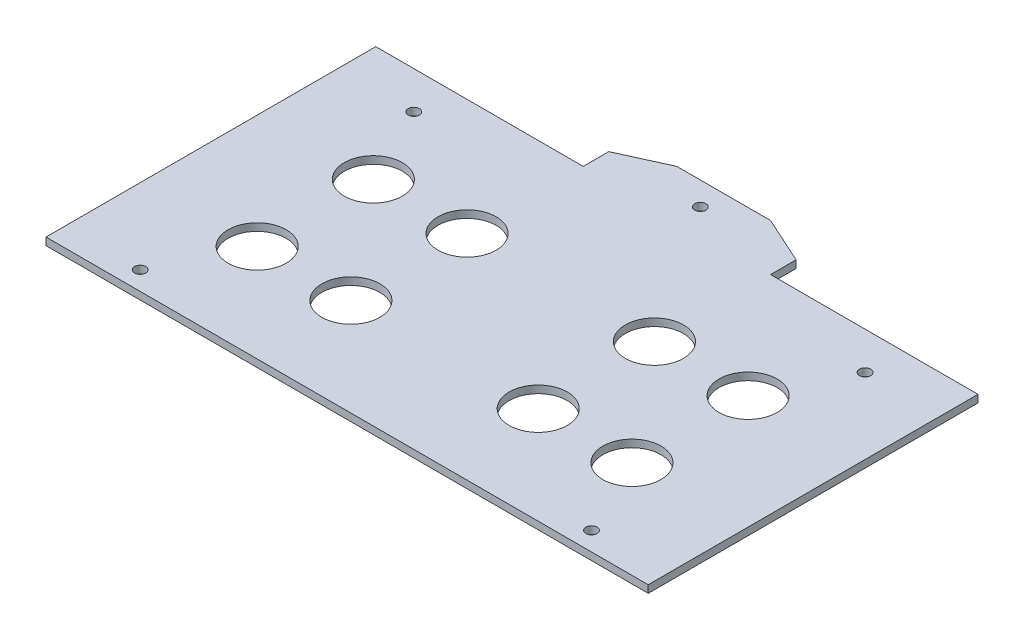
ISO-10303-21;
HEADER;
FILE_DESCRIPTION(('STEP AP214'),'2;1');
FILE_NAME('part.step','',(''),(''),'','','');
FILE_SCHEMA(('AUTOMOTIVE_DESIGN { 1 0 10303 214 1 1 1 1 }'));
ENDSEC;
DATA;
#1=APPLICATION_CONTEXT('core data for automotive mechanical design processes');
#2=APPLICATION_PROTOCOL_DEFINITION('international standard','automotive_design',2000,#1);
#3=PRODUCT_CONTEXT('',#1,'mechanical');
#4=PRODUCT('Part','Part','',(#3));
#5=PRODUCT_RELATED_PRODUCT_CATEGORY('part','',(#4));
#6=PRODUCT_DEFINITION_FORMATION('','',#4);
#7=PRODUCT_DEFINITION_CONTEXT('part definition',#1,'design');
#8=PRODUCT_DEFINITION('design','',#6,#7);
#9=PRODUCT_DEFINITION_SHAPE('','',#8);
#10=(LENGTH_UNIT() NAMED_UNIT(*) SI_UNIT(.MILLI.,.METRE.));
#11=(NAMED_UNIT(*) PLANE_ANGLE_UNIT() SI_UNIT($,.RADIAN.));
#12=(NAMED_UNIT(*) SI_UNIT($,.STERADIAN.) SOLID_ANGLE_UNIT());
#13=UNCERTAINTY_MEASURE_WITH_UNIT(LENGTH_MEASURE(1.E-05),#10,'distance_accuracy_value','');
#14=(GEOMETRIC_REPRESENTATION_CONTEXT(3) GLOBAL_UNCERTAINTY_ASSIGNED_CONTEXT((#13)) GLOBAL_UNIT_ASSIGNED_CONTEXT((#10,
#11,#12)) REPRESENTATION_CONTEXT('',''));
#15=CARTESIAN_POINT('',(0.,0.,0.));
#16=DIRECTION('',(0.,0.,1.));
#17=DIRECTION('',(1.,0.,0.));
#18=AXIS2_PLACEMENT_3D('',#15,#16,#17);
#19=CARTESIAN_POINT('',(0.,2.,-44.));
#20=DIRECTION('',(0.,0.,1.));
#21=DIRECTION('',(1.,0.,0.));
#22=AXIS2_PLACEMENT_3D('',#19,#20,#21);
#23=PLANE('',#22);
#24=DIRECTION('',(-1.,0.,0.));
#25=VECTOR('',#24,1.);
#26=CARTESIAN_POINT('',(0.,0.,-44.));
#27=LINE('',#26,#25);
#28=CARTESIAN_POINT('',(-23.8283042472908,0.,-44.));
#29=VERTEX_POINT('',#28);
#30=CARTESIAN_POINT('',(-79.1797078460986,0.,-44.));
#31=VERTEX_POINT('',#30);
#32=EDGE_CURVE('E160',#29,#31,#27,.T.);
#33=ORIENTED_EDGE('',*,*,#32,.T.);
#34=DIRECTION('',(0.,1.,0.));
#35=VECTOR('',#34,1.);
#36=CARTESIAN_POINT('',(-79.1797078460986,-8.,-44.));
#37=LINE('',#36,#35);
#38=CARTESIAN_POINT('',(-79.1797078460986,2.,-44.));
#39=VERTEX_POINT('',#38);
#40=EDGE_CURVE('E61',#31,#39,#37,.T.);
#41=ORIENTED_EDGE('',*,*,#40,.T.);
#42=DIRECTION('',(-1.,0.,0.));
#43=VECTOR('',#42,1.);
#44=CARTESIAN_POINT('',(0.,2.,-44.));
#45=LINE('',#44,#43);
#46=CARTESIAN_POINT('',(-23.8283042472908,2.,-44.));
#47=VERTEX_POINT('',#46);
#48=EDGE_CURVE('E137',#47,#39,#45,.T.);
#49=ORIENTED_EDGE('',*,*,#48,.F.);
#50=DIRECTION('',(0.,1.,0.));
#51=VECTOR('',#50,1.);
#52=CARTESIAN_POINT('',(-23.8283042472908,-51.537589944117,-44.));
#53=LINE('',#52,#51);
#54=EDGE_CURVE('E245',#29,#47,#53,.T.);
#55=ORIENTED_EDGE('',*,*,#54,.F.);
#56=EDGE_LOOP('',(#33,#41,#49,#55));
#57=FACE_BOUND('',#56,.T.);
#58=ADVANCED_FACE('F46',(#57),#23,.F.);
#59=CARTESIAN_POINT('',(81.523099351517,2.,-44.));
#60=VERTEX_POINT('',#59);
#61=CARTESIAN_POINT('',(26.1716957527092,2.,-44.));
#62=VERTEX_POINT('',#61);
#63=EDGE_CURVE('E141',#60,#62,#45,.T.);
#64=ORIENTED_EDGE('',*,*,#63,.F.);
#65=DIRECTION('',(0.,1.,0.));
#66=VECTOR('',#65,1.);
#67=CARTESIAN_POINT('',(81.523099351517,-8.,-44.));
#68=LINE('',#67,#66);
#69=CARTESIAN_POINT('',(81.523099351517,0.,-44.));
#70=VERTEX_POINT('',#69);
#71=EDGE_CURVE('E205',#70,#60,#68,.T.);
#72=ORIENTED_EDGE('',*,*,#71,.F.);
#73=CARTESIAN_POINT('',(26.1716957527092,0.,-44.));
#74=VERTEX_POINT('',#73);
#75=EDGE_CURVE('E157',#70,#74,#27,.T.);
#76=ORIENTED_EDGE('',*,*,#75,.T.);
#77=DIRECTION('',(0.,1.,0.));
#78=VECTOR('',#77,1.);
#79=CARTESIAN_POINT('',(26.1716957527092,-51.537589944117,-44.));
#80=LINE('',#79,#78);
#81=EDGE_CURVE('E221',#74,#62,#80,.T.);
#82=ORIENTED_EDGE('',*,*,#81,.T.);
#83=EDGE_LOOP('',(#64,#72,#76,#82));
#84=FACE_BOUND('',#83,.T.);
#85=ADVANCED_FACE('F48',(#84),#23,.F.);
#86=CARTESIAN_POINT('',(-59.0420655328614,2.,-34.));
#87=DIRECTION('',(0.,-1.,0.));
#88=DIRECTION('',(0.,0.,-1.));
#89=AXIS2_PLACEMENT_3D('',#86,#87,#88);
#90=CYLINDRICAL_SURFACE('',#89,1.5);
#91=CARTESIAN_POINT('',(-59.0420655328614,2.,-34.));
#92=DIRECTION('',(0.,1.,0.));
#93=DIRECTION('',(0.,0.,1.));
#94=AXIS2_PLACEMENT_3D('',#91,#92,#93);
#95=CIRCLE('',#94,1.5);
#96=CARTESIAN_POINT('',(-59.0420655328614,2.,-32.5));
#97=VERTEX_POINT('',#96);
#98=EDGE_CURVE('E151',#97,#97,#95,.T.);
#99=ORIENTED_EDGE('',*,*,#98,.T.);
#100=EDGE_LOOP('',(#99));
#101=FACE_BOUND('',#100,.T.);
#102=CARTESIAN_POINT('',(-59.0420655328614,0.,-34.));
#103=DIRECTION('',(0.,1.,0.));
#104=DIRECTION('',(0.,0.,1.));
#105=AXIS2_PLACEMENT_3D('',#102,#103,#104);
#106=CIRCLE('',#105,1.5);
#107=CARTESIAN_POINT('',(-59.0420655328614,0.,-32.5));
#108=VERTEX_POINT('',#107);
#109=EDGE_CURVE('E168',#108,#108,#106,.T.);
#110=ORIENTED_EDGE('',*,*,#109,.F.);
#111=EDGE_LOOP('',(#110));
#112=FACE_BOUND('',#111,.T.);
#113=ADVANCED_FACE('F316',(#101,#112),#90,.F.);
#114=CARTESIAN_POINT('',(-59.0420655328614,2.,39.));
#115=DIRECTION('',(0.,-1.,0.));
#116=DIRECTION('',(0.,0.,-1.));
#117=AXIS2_PLACEMENT_3D('',#114,#115,#116);
#118=CYLINDRICAL_SURFACE('',#117,1.5);
#119=CARTESIAN_POINT('',(-59.0420655328614,2.,39.));
#120=DIRECTION('',(0.,1.,0.));
#121=DIRECTION('',(0.,0.,1.));
#122=AXIS2_PLACEMENT_3D('',#119,#120,#121);
#123=CIRCLE('',#122,1.5);
#124=CARTESIAN_POINT('',(-59.0420655328614,2.,40.5));
#125=VERTEX_POINT('',#124);
#126=EDGE_CURVE('E144',#125,#125,#123,.T.);
#127=ORIENTED_EDGE('',*,*,#126,.T.);
#128=EDGE_LOOP('',(#127));
#129=FACE_BOUND('',#128,.T.);
#130=CARTESIAN_POINT('',(-59.0420655328614,0.,39.));
#131=DIRECTION('',(0.,1.,0.));
#132=DIRECTION('',(0.,0.,1.));
#133=AXIS2_PLACEMENT_3D('',#130,#131,#132);
#134=CIRCLE('',#133,1.5);
#135=CARTESIAN_POINT('',(-59.0420655328614,0.,40.5));
#136=VERTEX_POINT('',#135);
#137=EDGE_CURVE('E165',#136,#136,#134,.T.);
#138=ORIENTED_EDGE('',*,*,#137,.F.);
#139=EDGE_LOOP('',(#138));
#140=FACE_BOUND('',#139,.T.);
#141=ADVANCED_FACE('F387',(#129,#140),#118,.F.);
#142=CARTESIAN_POINT('',(61.3854570382798,2.,39.));
#143=DIRECTION('',(0.,-1.,0.));
#144=DIRECTION('',(0.,0.,-1.));
#145=AXIS2_PLACEMENT_3D('',#142,#143,#144);
#146=CYLINDRICAL_SURFACE('',#145,1.5);
#147=CARTESIAN_POINT('',(61.3854570382798,2.,39.));
#148=DIRECTION('',(0.,1.,0.));
#149=DIRECTION('',(0.,0.,1.));
#150=AXIS2_PLACEMENT_3D('',#147,#148,#149);
#151=CIRCLE('',#150,1.5);
#152=CARTESIAN_POINT('',(61.3854570382798,2.,40.5));
#153=VERTEX_POINT('',#152);
#154=EDGE_CURVE('E140',#153,#153,#151,.T.);
#155=ORIENTED_EDGE('',*,*,#154,.T.);
#156=EDGE_LOOP('',(#155));
#157=FACE_BOUND('',#156,.T.);
#158=CARTESIAN_POINT('',(61.3854570382798,0.,39.));
#159=DIRECTION('',(0.,1.,0.));
#160=DIRECTION('',(0.,0.,1.));
#161=AXIS2_PLACEMENT_3D('',#158,#159,#160);
#162=CIRCLE('',#161,1.5);
#163=CARTESIAN_POINT('',(61.3854570382798,0.,40.5));
#164=VERTEX_POINT('',#163);
#165=EDGE_CURVE('E162',#164,#164,#162,.T.);
#166=ORIENTED_EDGE('',*,*,#165,.F.);
#167=EDGE_LOOP('',(#166));
#168=FACE_BOUND('',#167,.T.);
#169=ADVANCED_FACE('F391',(#157,#168),#146,.F.);
#170=CARTESIAN_POINT('',(0.,2.,44.));
#171=DIRECTION('',(0.,0.,-1.));
#172=DIRECTION('',(-1.,0.,0.));
#173=AXIS2_PLACEMENT_3D('',#170,#171,#172);
#174=PLANE('',#173);
#175=DIRECTION('',(1.,0.,0.));
#176=VECTOR('',#175,1.);
#177=CARTESIAN_POINT('',(0.,2.,44.));
#178=LINE('',#177,#176);
#179=CARTESIAN_POINT('',(-79.1797078460986,2.,44.));
#180=VERTEX_POINT('',#179);
#181=CARTESIAN_POINT('',(81.523099351517,2.,44.));
#182=VERTEX_POINT('',#181);
#183=EDGE_CURVE('E135',#180,#182,#178,.T.);
#184=ORIENTED_EDGE('',*,*,#183,.F.);
#185=DIRECTION('',(0.,1.,0.));
#186=VECTOR('',#185,1.);
#187=CARTESIAN_POINT('',(-79.1797078460986,-8.,44.));
#188=LINE('',#187,#186);
#189=CARTESIAN_POINT('',(-79.1797078460986,0.,44.));
#190=VERTEX_POINT('',#189);
#191=EDGE_CURVE('E120',#190,#180,#188,.T.);
#192=ORIENTED_EDGE('',*,*,#191,.F.);
#193=DIRECTION('',(1.,0.,0.));
#194=VECTOR('',#193,1.);
#195=CARTESIAN_POINT('',(0.,0.,44.));
#196=LINE('',#195,#194);
#197=CARTESIAN_POINT('',(81.523099351517,0.,44.));
#198=VERTEX_POINT('',#197);
#199=EDGE_CURVE('E159',#190,#198,#196,.T.);
#200=ORIENTED_EDGE('',*,*,#199,.T.);
#201=DIRECTION('',(0.,1.,0.));
#202=VECTOR('',#201,1.);
#203=CARTESIAN_POINT('',(81.523099351517,-8.,44.));
#204=LINE('',#203,#202);
#205=EDGE_CURVE('E68',#198,#182,#204,.T.);
#206=ORIENTED_EDGE('',*,*,#205,.T.);
#207=EDGE_LOOP('',(#184,#192,#200,#206));
#208=FACE_BOUND('',#207,.T.);
#209=ADVANCED_FACE('F139',(#208),#174,.F.);
#210=CARTESIAN_POINT('',(61.3854570382798,2.,-34.));
#211=DIRECTION('',(0.,-1.,0.));
#212=DIRECTION('',(0.,0.,-1.));
#213=AXIS2_PLACEMENT_3D('',#210,#211,#212);
#214=CYLINDRICAL_SURFACE('',#213,1.5);
#215=CARTESIAN_POINT('',(61.3854570382798,2.,-34.));
#216=DIRECTION('',(0.,1.,0.));
#217=DIRECTION('',(0.,0.,1.));
#218=AXIS2_PLACEMENT_3D('',#215,#216,#217);
#219=CIRCLE('',#218,1.5);
#220=CARTESIAN_POINT('',(61.3854570382798,2.,-32.5));
#221=VERTEX_POINT('',#220);
#222=EDGE_CURVE('E154',#221,#221,#219,.T.);
#223=ORIENTED_EDGE('',*,*,#222,.T.);
#224=EDGE_LOOP('',(#223));
#225=FACE_BOUND('',#224,.T.);
#226=CARTESIAN_POINT('',(61.3854570382798,0.,-34.));
#227=DIRECTION('',(0.,1.,0.));
#228=DIRECTION('',(0.,0.,1.));
#229=AXIS2_PLACEMENT_3D('',#226,#227,#228);
#230=CIRCLE('',#229,1.5);
#231=CARTESIAN_POINT('',(61.3854570382798,0.,-32.5));
#232=VERTEX_POINT('',#231);
#233=EDGE_CURVE('E171',#232,#232,#230,.T.);
#234=ORIENTED_EDGE('',*,*,#233,.F.);
#235=EDGE_LOOP('',(#234));
#236=FACE_BOUND('',#235,.T.);
#237=ADVANCED_FACE('F285',(#225,#236),#214,.F.);
#238=CARTESIAN_POINT('',(0.,2.,0.));
#239=DIRECTION('',(0.,1.,0.));
#240=DIRECTION('',(0.,0.,1.));
#241=AXIS2_PLACEMENT_3D('',#238,#239,#240);
#242=PLANE('',#241);
#243=DIRECTION('',(0.,0.,-1.));
#244=VECTOR('',#243,1.);
#245=CARTESIAN_POINT('',(-79.1797078460986,2.,-44.));
#246=LINE('',#245,#244);
#247=EDGE_CURVE('E123',#180,#39,#246,.T.);
#248=ORIENTED_EDGE('',*,*,#247,.F.);
#249=ORIENTED_EDGE('',*,*,#183,.T.);
#250=DIRECTION('',(0.,0.,1.));
#251=VECTOR('',#250,1.);
#252=CARTESIAN_POINT('',(81.523099351517,2.,-44.));
#253=LINE('',#252,#251);
#254=EDGE_CURVE('E209',#60,#182,#253,.T.);
#255=ORIENTED_EDGE('',*,*,#254,.F.);
#256=ORIENTED_EDGE('',*,*,#63,.T.);
#257=DIRECTION('',(0.,0.,-1.));
#258=VECTOR('',#257,1.);
#259=CARTESIAN_POINT('',(26.1716957527092,2.,-44.));
#260=LINE('',#259,#258);
#261=CARTESIAN_POINT('',(26.1716957527092,2.,-50.823606938333));
#262=VERTEX_POINT('',#261);
#263=EDGE_CURVE('E229',#62,#262,#260,.T.);
#264=ORIENTED_EDGE('',*,*,#263,.T.);
#265=DIRECTION('',(-0.910654396943774,0.,-0.41316893557838));
#266=VECTOR('',#265,1.);
#267=CARTESIAN_POINT('',(26.1716957527092,2.,-50.823606938333));
#268=LINE('',#267,#266);
#269=CARTESIAN_POINT('',(13.6716957527092,2.,-56.4949260601234));
#270=VERTEX_POINT('',#269);
#271=EDGE_CURVE('E232',#262,#270,#268,.T.);
#272=ORIENTED_EDGE('',*,*,#271,.T.);
#273=DIRECTION('',(-1.,0.,0.));
#274=VECTOR('',#273,1.);
#275=CARTESIAN_POINT('',(13.6716957527092,2.,-56.4949260601234));
#276=LINE('',#275,#274);
#277=CARTESIAN_POINT('',(-11.3283042472908,2.,-56.4949260601234));
#278=VERTEX_POINT('',#277);
#279=EDGE_CURVE('E235',#270,#278,#276,.T.);
#280=ORIENTED_EDGE('',*,*,#279,.T.);
#281=DIRECTION('',(-0.910654396943774,0.,0.41316893557838));
#282=VECTOR('',#281,1.);
#283=CARTESIAN_POINT('',(-11.3283042472908,2.,-56.4949260601234));
#284=LINE('',#283,#282);
#285=CARTESIAN_POINT('',(-23.8283042472908,2.,-50.823606938333));
#286=VERTEX_POINT('',#285);
#287=EDGE_CURVE('E238',#278,#286,#284,.T.);
#288=ORIENTED_EDGE('',*,*,#287,.T.);
#289=DIRECTION('',(0.,0.,1.));
#290=VECTOR('',#289,1.);
#291=CARTESIAN_POINT('',(-23.8283042472908,2.,-50.823606938333));
#292=LINE('',#291,#290);
#293=EDGE_CURVE('E241',#286,#47,#292,.T.);
#294=ORIENTED_EDGE('',*,*,#293,.T.);
#295=ORIENTED_EDGE('',*,*,#48,.T.);
#296=EDGE_LOOP('',(#248,#249,#255,#256,#264,#272,#280,#288,#294,#295));
#297=FACE_BOUND('',#296,.T.);
#298=CARTESIAN_POINT('',(-23.8283042472908,2.,18.0000000000002));
#299=DIRECTION('',(0.,1.,0.));
#300=DIRECTION('',(0.,0.,-1.));
#301=AXIS2_PLACEMENT_3D('',#298,#299,#300);
#302=CIRCLE('',#301,7.75);
#303=CARTESIAN_POINT('',(-23.8283042472908,2.,10.2500000000002));
#304=VERTEX_POINT('',#303);
#305=EDGE_CURVE('E270',#304,#304,#302,.T.);
#306=ORIENTED_EDGE('',*,*,#305,.F.);
#307=EDGE_LOOP('',(#306));
#308=FACE_BOUND('',#307,.T.);
#309=CARTESIAN_POINT('',(51.1716957527092,2.,18.0000000000004));
#310=DIRECTION('',(0.,1.,0.));
#311=DIRECTION('',(0.,0.,-1.));
#312=AXIS2_PLACEMENT_3D('',#309,#310,#311);
#313=CIRCLE('',#312,7.75);
#314=CARTESIAN_POINT('',(51.1716957527092,2.,10.2500000000004));
#315=VERTEX_POINT('',#314);
#316=EDGE_CURVE('E273',#315,#315,#313,.T.);
#317=ORIENTED_EDGE('',*,*,#316,.F.);
#318=EDGE_LOOP('',(#317));
#319=FACE_BOUND('',#318,.T.);
#320=CARTESIAN_POINT('',(26.1716957527092,2.,18.0000000000004));
#321=DIRECTION('',(0.,1.,0.));
#322=DIRECTION('',(0.,0.,-1.));
#323=AXIS2_PLACEMENT_3D('',#320,#321,#322);
#324=CIRCLE('',#323,7.75);
#325=CARTESIAN_POINT('',(26.1716957527092,2.,10.2500000000004));
#326=VERTEX_POINT('',#325);
#327=EDGE_CURVE('E257',#326,#326,#324,.T.);
#328=ORIENTED_EDGE('',*,*,#327,.F.);
#329=EDGE_LOOP('',(#328));
#330=FACE_BOUND('',#329,.T.);
#331=CARTESIAN_POINT('',(-48.8283042472908,2.,-13.));
#332=DIRECTION('',(0.,1.,0.));
#333=DIRECTION('',(0.,0.,1.));
#334=AXIS2_PLACEMENT_3D('',#331,#332,#333);
#335=CIRCLE('',#334,7.75);
#336=CARTESIAN_POINT('',(-48.8283042472908,2.,-5.25));
#337=VERTEX_POINT('',#336);
#338=EDGE_CURVE('E267',#337,#337,#335,.T.);
#339=ORIENTED_EDGE('',*,*,#338,.F.);
#340=EDGE_LOOP('',(#339));
#341=FACE_BOUND('',#340,.T.);
#342=CARTESIAN_POINT('',(-23.8283042472908,2.,-13.0000000000002));
#343=DIRECTION('',(0.,1.,0.));
#344=DIRECTION('',(0.,0.,1.));
#345=AXIS2_PLACEMENT_3D('',#342,#343,#344);
#346=CIRCLE('',#345,7.75);
#347=CARTESIAN_POINT('',(-23.8283042472908,2.,-5.25000000000018));
#348=VERTEX_POINT('',#347);
#349=EDGE_CURVE('E264',#348,#348,#346,.T.);
#350=ORIENTED_EDGE('',*,*,#349,.F.);
#351=EDGE_LOOP('',(#350));
#352=FACE_BOUND('',#351,.T.);
#353=CARTESIAN_POINT('',(51.1716957527092,2.,-13.0000000000003));
#354=DIRECTION('',(0.,1.,0.));
#355=DIRECTION('',(0.,0.,1.));
#356=AXIS2_PLACEMENT_3D('',#353,#354,#355);
#357=CIRCLE('',#356,7.75);
#358=CARTESIAN_POINT('',(51.1716957527092,2.,-5.25000000000035));
#359=VERTEX_POINT('',#358);
#360=EDGE_CURVE('E261',#359,#359,#357,.T.);
#361=ORIENTED_EDGE('',*,*,#360,.F.);
#362=EDGE_LOOP('',(#361));
#363=FACE_BOUND('',#362,.T.);
#364=CARTESIAN_POINT('',(26.1716957527092,2.,-13.0000000000003));
#365=DIRECTION('',(0.,1.,0.));
#366=DIRECTION('',(0.,0.,1.));
#367=AXIS2_PLACEMENT_3D('',#364,#365,#366);
#368=CIRCLE('',#367,7.75);
#369=CARTESIAN_POINT('',(26.1716957527092,2.,-5.25000000000035));
#370=VERTEX_POINT('',#369);
#371=EDGE_CURVE('E258',#370,#370,#368,.T.);
#372=ORIENTED_EDGE('',*,*,#371,.F.);
#373=EDGE_LOOP('',(#372));
#374=FACE_BOUND('',#373,.T.);
#375=CARTESIAN_POINT('',(-48.8283042472908,2.,18.));
#376=DIRECTION('',(0.,1.,0.));
#377=DIRECTION('',(0.,0.,-1.));
#378=AXIS2_PLACEMENT_3D('',#375,#376,#377);
#379=CIRCLE('',#378,7.75);
#380=CARTESIAN_POINT('',(-48.8283042472908,2.,10.25));
#381=VERTEX_POINT('',#380);
#382=EDGE_CURVE('E178',#381,#381,#379,.T.);
#383=ORIENTED_EDGE('',*,*,#382,.F.);
#384=EDGE_LOOP('',(#383));
#385=FACE_BOUND('',#384,.T.);
#386=ORIENTED_EDGE('',*,*,#154,.F.);
#387=EDGE_LOOP('',(#386));
#388=FACE_BOUND('',#387,.T.);
#389=ORIENTED_EDGE('',*,*,#126,.F.);
#390=EDGE_LOOP('',(#389));
#391=FACE_BOUND('',#390,.T.);
#392=ORIENTED_EDGE('',*,*,#98,.F.);
#393=EDGE_LOOP('',(#392));
#394=FACE_BOUND('',#393,.T.);
#395=ORIENTED_EDGE('',*,*,#222,.F.);
#396=EDGE_LOOP('',(#395));
#397=FACE_BOUND('',#396,.T.);
#398=CARTESIAN_POINT('',(1.1716957527092,2.,-50.2474630300617));
#399=DIRECTION('',(0.,1.,0.));
#400=DIRECTION('',(0.,0.,1.));
#401=AXIS2_PLACEMENT_3D('',#398,#399,#400);
#402=CIRCLE('',#401,1.5);
#403=CARTESIAN_POINT('',(1.1716957527092,2.,-48.7474630300617));
#404=VERTEX_POINT('',#403);
#405=EDGE_CURVE('E226',#404,#404,#402,.T.);
#406=ORIENTED_EDGE('',*,*,#405,.F.);
#407=EDGE_LOOP('',(#406));
#408=FACE_BOUND('',#407,.T.);
#409=ADVANCED_FACE('F132',(#297,#308,#319,#330,#341,#352,#363,#374,#385,#388,#391,#394,#397,
#408),#242,.T.);
#410=CARTESIAN_POINT('',(0.,0.,0.));
#411=DIRECTION('',(0.,1.,0.));
#412=DIRECTION('',(0.,0.,1.));
#413=AXIS2_PLACEMENT_3D('',#410,#411,#412);
#414=PLANE('',#413);
#415=CARTESIAN_POINT('',(-23.8283042472908,0.,18.0000000000002));
#416=DIRECTION('',(0.,1.,0.));
#417=DIRECTION('',(0.,0.,1.));
#418=AXIS2_PLACEMENT_3D('',#415,#416,#417);
#419=CIRCLE('',#418,7.75);
#420=CARTESIAN_POINT('',(-23.8283042472908,0.,25.7500000000002));
#421=VERTEX_POINT('',#420);
#422=EDGE_CURVE('E196',#421,#421,#419,.T.);
#423=ORIENTED_EDGE('',*,*,#422,.T.);
#424=EDGE_LOOP('',(#423));
#425=FACE_BOUND('',#424,.T.);
#426=CARTESIAN_POINT('',(51.1716957527092,0.,18.0000000000004));
#427=DIRECTION('',(0.,1.,0.));
#428=DIRECTION('',(0.,0.,1.));
#429=AXIS2_PLACEMENT_3D('',#426,#427,#428);
#430=CIRCLE('',#429,7.75);
#431=CARTESIAN_POINT('',(51.1716957527092,0.,25.7500000000004));
#432=VERTEX_POINT('',#431);
#433=EDGE_CURVE('E193',#432,#432,#430,.T.);
#434=ORIENTED_EDGE('',*,*,#433,.T.);
#435=EDGE_LOOP('',(#434));
#436=FACE_BOUND('',#435,.T.);
#437=CARTESIAN_POINT('',(26.1716957527092,0.,18.0000000000004));
#438=DIRECTION('',(0.,1.,0.));
#439=DIRECTION('',(0.,0.,1.));
#440=AXIS2_PLACEMENT_3D('',#437,#438,#439);
#441=CIRCLE('',#440,7.75);
#442=CARTESIAN_POINT('',(26.1716957527092,0.,25.7500000000004));
#443=VERTEX_POINT('',#442);
#444=EDGE_CURVE('E190',#443,#443,#441,.T.);
#445=ORIENTED_EDGE('',*,*,#444,.T.);
#446=EDGE_LOOP('',(#445));
#447=FACE_BOUND('',#446,.T.);
#448=CARTESIAN_POINT('',(-48.8283042472908,0.,-13.));
#449=DIRECTION('',(0.,1.,0.));
#450=DIRECTION('',(0.,0.,1.));
#451=AXIS2_PLACEMENT_3D('',#448,#449,#450);
#452=CIRCLE('',#451,7.75);
#453=CARTESIAN_POINT('',(-48.8283042472908,0.,-5.25));
#454=VERTEX_POINT('',#453);
#455=EDGE_CURVE('E187',#454,#454,#452,.T.);
#456=ORIENTED_EDGE('',*,*,#455,.T.);
#457=EDGE_LOOP('',(#456));
#458=FACE_BOUND('',#457,.T.);
#459=CARTESIAN_POINT('',(-23.8283042472908,0.,-13.0000000000002));
#460=DIRECTION('',(0.,1.,0.));
#461=DIRECTION('',(0.,0.,1.));
#462=AXIS2_PLACEMENT_3D('',#459,#460,#461);
#463=CIRCLE('',#462,7.75);
#464=CARTESIAN_POINT('',(-23.8283042472908,0.,-5.25000000000018));
#465=VERTEX_POINT('',#464);
#466=EDGE_CURVE('E184',#465,#465,#463,.T.);
#467=ORIENTED_EDGE('',*,*,#466,.T.);
#468=EDGE_LOOP('',(#467));
#469=FACE_BOUND('',#468,.T.);
#470=CARTESIAN_POINT('',(51.1716957527092,0.,-13.0000000000003));
#471=DIRECTION('',(0.,1.,0.));
#472=DIRECTION('',(0.,0.,1.));
#473=AXIS2_PLACEMENT_3D('',#470,#471,#472);
#474=CIRCLE('',#473,7.75);
#475=CARTESIAN_POINT('',(51.1716957527092,0.,-5.25000000000035));
#476=VERTEX_POINT('',#475);
#477=EDGE_CURVE('E181',#476,#476,#474,.T.);
#478=ORIENTED_EDGE('',*,*,#477,.T.);
#479=EDGE_LOOP('',(#478));
#480=FACE_BOUND('',#479,.T.);
#481=CARTESIAN_POINT('',(26.1716957527092,0.,-13.0000000000003));
#482=DIRECTION('',(0.,1.,0.));
#483=DIRECTION('',(0.,0.,1.));
#484=AXIS2_PLACEMENT_3D('',#481,#482,#483);
#485=CIRCLE('',#484,7.75);
#486=CARTESIAN_POINT('',(26.1716957527092,0.,-5.25000000000035));
#487=VERTEX_POINT('',#486);
#488=EDGE_CURVE('E177',#487,#487,#485,.T.);
#489=ORIENTED_EDGE('',*,*,#488,.T.);
#490=EDGE_LOOP('',(#489));
#491=FACE_BOUND('',#490,.T.);
#492=CARTESIAN_POINT('',(-48.8283042472908,0.,18.));
#493=DIRECTION('',(0.,1.,0.));
#494=DIRECTION('',(0.,0.,1.));
#495=AXIS2_PLACEMENT_3D('',#492,#493,#494);
#496=CIRCLE('',#495,7.75);
#497=CARTESIAN_POINT('',(-48.8283042472908,0.,25.75));
#498=VERTEX_POINT('',#497);
#499=EDGE_CURVE('E174',#498,#498,#496,.T.);
#500=ORIENTED_EDGE('',*,*,#499,.T.);
#501=EDGE_LOOP('',(#500));
#502=FACE_BOUND('',#501,.T.);
#503=ORIENTED_EDGE('',*,*,#199,.F.);
#504=DIRECTION('',(0.,0.,-1.));
#505=VECTOR('',#504,1.);
#506=CARTESIAN_POINT('',(-79.1797078460986,0.,0.));
#507=LINE('',#506,#505);
#508=EDGE_CURVE('E11',#190,#31,#507,.T.);
#509=ORIENTED_EDGE('',*,*,#508,.T.);
#510=ORIENTED_EDGE('',*,*,#32,.F.);
#511=DIRECTION('',(0.,0.,-1.));
#512=VECTOR('',#511,1.);
#513=CARTESIAN_POINT('',(-23.8283042472908,0.,-50.823606938333));
#514=LINE('',#513,#512);
#515=CARTESIAN_POINT('',(-23.8283042472908,0.,-50.823606938333));
#516=VERTEX_POINT('',#515);
#517=EDGE_CURVE('E223',#29,#516,#514,.T.);
#518=ORIENTED_EDGE('',*,*,#517,.T.);
#519=DIRECTION('',(0.910654396943774,0.,-0.41316893557838));
#520=VECTOR('',#519,1.);
#521=CARTESIAN_POINT('',(-11.3283042472908,0.,-56.4949260601234));
#522=LINE('',#521,#520);
#523=CARTESIAN_POINT('',(-11.3283042472908,0.,-56.4949260601234));
#524=VERTEX_POINT('',#523);
#525=EDGE_CURVE('E220',#516,#524,#522,.T.);
#526=ORIENTED_EDGE('',*,*,#525,.T.);
#527=DIRECTION('',(1.,0.,0.));
#528=VECTOR('',#527,1.);
#529=CARTESIAN_POINT('',(13.6716957527092,0.,-56.4949260601234));
#530=LINE('',#529,#528);
#531=CARTESIAN_POINT('',(13.6716957527092,0.,-56.4949260601234));
#532=VERTEX_POINT('',#531);
#533=EDGE_CURVE('E218',#524,#532,#530,.T.);
#534=ORIENTED_EDGE('',*,*,#533,.T.);
#535=DIRECTION('',(0.910654396943774,0.,0.41316893557838));
#536=VECTOR('',#535,1.);
#537=CARTESIAN_POINT('',(26.1716957527092,0.,-50.823606938333));
#538=LINE('',#537,#536);
#539=CARTESIAN_POINT('',(26.1716957527092,0.,-50.823606938333));
#540=VERTEX_POINT('',#539);
#541=EDGE_CURVE('E214',#532,#540,#538,.T.);
#542=ORIENTED_EDGE('',*,*,#541,.T.);
#543=DIRECTION('',(0.,0.,1.));
#544=VECTOR('',#543,1.);
#545=CARTESIAN_POINT('',(26.1716957527092,0.,-44.));
#546=LINE('',#545,#544);
#547=EDGE_CURVE('E217',#540,#74,#546,.T.);
#548=ORIENTED_EDGE('',*,*,#547,.T.);
#549=ORIENTED_EDGE('',*,*,#75,.F.);
#550=DIRECTION('',(0.,0.,1.));
#551=VECTOR('',#550,1.);
#552=CARTESIAN_POINT('',(81.523099351517,0.,0.));
#553=LINE('',#552,#551);
#554=EDGE_CURVE('E54',#70,#198,#553,.T.);
#555=ORIENTED_EDGE('',*,*,#554,.T.);
#556=EDGE_LOOP('',(#503,#509,#510,#518,#526,#534,#542,#548,#549,#555));
#557=FACE_BOUND('',#556,.T.);
#558=ORIENTED_EDGE('',*,*,#165,.T.);
#559=EDGE_LOOP('',(#558));
#560=FACE_BOUND('',#559,.T.);
#561=ORIENTED_EDGE('',*,*,#137,.T.);
#562=EDGE_LOOP('',(#561));
#563=FACE_BOUND('',#562,.T.);
#564=ORIENTED_EDGE('',*,*,#109,.T.);
#565=EDGE_LOOP('',(#564));
#566=FACE_BOUND('',#565,.T.);
#567=ORIENTED_EDGE('',*,*,#233,.T.);
#568=EDGE_LOOP('',(#567));
#569=FACE_BOUND('',#568,.T.);
#570=CARTESIAN_POINT('',(1.1716957527092,0.,-50.2474630300617));
#571=DIRECTION('',(0.,1.,0.));
#572=DIRECTION('',(0.,0.,1.));
#573=AXIS2_PLACEMENT_3D('',#570,#571,#572);
#574=CIRCLE('',#573,1.5);
#575=CARTESIAN_POINT('',(1.1716957527092,0.,-48.7474630300617));
#576=VERTEX_POINT('',#575);
#577=EDGE_CURVE('E216',#576,#576,#574,.F.);
#578=ORIENTED_EDGE('',*,*,#577,.F.);
#579=EDGE_LOOP('',(#578));
#580=FACE_BOUND('',#579,.T.);
#581=ADVANCED_FACE('F200',(#425,#436,#447,#458,#469,#480,#491,#502,#557,#560,#563,#566,#569,
#580),#414,.F.);
#582=CARTESIAN_POINT('',(-48.8283042472908,-8.,18.));
#583=DIRECTION('',(0.,1.,0.));
#584=DIRECTION('',(0.,0.,1.));
#585=AXIS2_PLACEMENT_3D('',#582,#583,#584);
#586=CYLINDRICAL_SURFACE('',#585,7.75);
#587=ORIENTED_EDGE('',*,*,#382,.T.);
#588=EDGE_LOOP('',(#587));
#589=FACE_BOUND('',#588,.T.);
#590=ORIENTED_EDGE('',*,*,#499,.F.);
#591=EDGE_LOOP('',(#590));
#592=FACE_BOUND('',#591,.T.);
#593=ADVANCED_FACE('F280',(#589,#592),#586,.F.);
#594=CARTESIAN_POINT('',(26.1716957527092,-8.,-13.0000000000003));
#595=DIRECTION('',(0.,1.,0.));
#596=DIRECTION('',(0.,0.,1.));
#597=AXIS2_PLACEMENT_3D('',#594,#595,#596);
#598=CYLINDRICAL_SURFACE('',#597,7.75);
#599=ORIENTED_EDGE('',*,*,#371,.T.);
#600=EDGE_LOOP('',(#599));
#601=FACE_BOUND('',#600,.T.);
#602=ORIENTED_EDGE('',*,*,#488,.F.);
#603=EDGE_LOOP('',(#602));
#604=FACE_BOUND('',#603,.T.);
#605=ADVANCED_FACE('F354',(#601,#604),#598,.F.);
#606=CARTESIAN_POINT('',(51.1716957527092,-8.,-13.0000000000003));
#607=DIRECTION('',(0.,1.,0.));
#608=DIRECTION('',(0.,0.,1.));
#609=AXIS2_PLACEMENT_3D('',#606,#607,#608);
#610=CYLINDRICAL_SURFACE('',#609,7.75);
#611=ORIENTED_EDGE('',*,*,#360,.T.);
#612=EDGE_LOOP('',(#611));
#613=FACE_BOUND('',#612,.T.);
#614=ORIENTED_EDGE('',*,*,#477,.F.);
#615=EDGE_LOOP('',(#614));
#616=FACE_BOUND('',#615,.T.);
#617=ADVANCED_FACE('F357',(#613,#616),#610,.F.);
#618=CARTESIAN_POINT('',(-23.8283042472908,-8.,-13.0000000000002));
#619=DIRECTION('',(0.,1.,0.));
#620=DIRECTION('',(0.,0.,1.));
#621=AXIS2_PLACEMENT_3D('',#618,#619,#620);
#622=CYLINDRICAL_SURFACE('',#621,7.75);
#623=ORIENTED_EDGE('',*,*,#349,.T.);
#624=EDGE_LOOP('',(#623));
#625=FACE_BOUND('',#624,.T.);
#626=ORIENTED_EDGE('',*,*,#466,.F.);
#627=EDGE_LOOP('',(#626));
#628=FACE_BOUND('',#627,.T.);
#629=ADVANCED_FACE('F361',(#625,#628),#622,.F.);
#630=CARTESIAN_POINT('',(-48.8283042472908,-8.,-13.));
#631=DIRECTION('',(0.,1.,0.));
#632=DIRECTION('',(0.,0.,1.));
#633=AXIS2_PLACEMENT_3D('',#630,#631,#632);
#634=CYLINDRICAL_SURFACE('',#633,7.75);
#635=ORIENTED_EDGE('',*,*,#338,.T.);
#636=EDGE_LOOP('',(#635));
#637=FACE_BOUND('',#636,.T.);
#638=ORIENTED_EDGE('',*,*,#455,.F.);
#639=EDGE_LOOP('',(#638));
#640=FACE_BOUND('',#639,.T.);
#641=ADVANCED_FACE('F365',(#637,#640),#634,.F.);
#642=CARTESIAN_POINT('',(26.1716957527092,-8.,18.0000000000004));
#643=DIRECTION('',(0.,1.,0.));
#644=DIRECTION('',(0.,0.,1.));
#645=AXIS2_PLACEMENT_3D('',#642,#643,#644);
#646=CYLINDRICAL_SURFACE('',#645,7.75);
#647=ORIENTED_EDGE('',*,*,#327,.T.);
#648=EDGE_LOOP('',(#647));
#649=FACE_BOUND('',#648,.T.);
#650=ORIENTED_EDGE('',*,*,#444,.F.);
#651=EDGE_LOOP('',(#650));
#652=FACE_BOUND('',#651,.T.);
#653=ADVANCED_FACE('F369',(#649,#652),#646,.F.);
#654=CARTESIAN_POINT('',(51.1716957527092,-8.,18.0000000000004));
#655=DIRECTION('',(0.,1.,0.));
#656=DIRECTION('',(0.,0.,1.));
#657=AXIS2_PLACEMENT_3D('',#654,#655,#656);
#658=CYLINDRICAL_SURFACE('',#657,7.75);
#659=ORIENTED_EDGE('',*,*,#316,.T.);
#660=EDGE_LOOP('',(#659));
#661=FACE_BOUND('',#660,.T.);
#662=ORIENTED_EDGE('',*,*,#433,.F.);
#663=EDGE_LOOP('',(#662));
#664=FACE_BOUND('',#663,.T.);
#665=ADVANCED_FACE('F349',(#661,#664),#658,.F.);
#666=CARTESIAN_POINT('',(-23.8283042472908,-8.,18.0000000000002));
#667=DIRECTION('',(0.,1.,0.));
#668=DIRECTION('',(0.,0.,1.));
#669=AXIS2_PLACEMENT_3D('',#666,#667,#668);
#670=CYLINDRICAL_SURFACE('',#669,7.75);
#671=ORIENTED_EDGE('',*,*,#305,.T.);
#672=EDGE_LOOP('',(#671));
#673=FACE_BOUND('',#672,.T.);
#674=ORIENTED_EDGE('',*,*,#422,.F.);
#675=EDGE_LOOP('',(#674));
#676=FACE_BOUND('',#675,.T.);
#677=ADVANCED_FACE('F342',(#673,#676),#670,.F.);
#678=CARTESIAN_POINT('',(26.1716957527092,-51.537589944117,-50.823606938333));
#679=DIRECTION('',(0.41316893557838,0.,-0.910654396943774));
#680=DIRECTION('',(-0.910654396943774,0.,-0.41316893557838));
#681=AXIS2_PLACEMENT_3D('',#678,#679,#680);
#682=PLANE('',#681);
#683=ORIENTED_EDGE('',*,*,#541,.F.);
#684=DIRECTION('',(0.,1.,0.));
#685=VECTOR('',#684,1.);
#686=CARTESIAN_POINT('',(13.6716957527092,-51.537589944117,-56.4949260601234));
#687=LINE('',#686,#685);
#688=EDGE_CURVE('E252',#532,#270,#687,.T.);
#689=ORIENTED_EDGE('',*,*,#688,.T.);
#690=ORIENTED_EDGE('',*,*,#271,.F.);
#691=DIRECTION('',(0.,1.,0.));
#692=VECTOR('',#691,1.);
#693=CARTESIAN_POINT('',(26.1716957527092,-51.537589944117,-50.823606938333));
#694=LINE('',#693,#692);
#695=EDGE_CURVE('E243',#540,#262,#694,.T.);
#696=ORIENTED_EDGE('',*,*,#695,.F.);
#697=EDGE_LOOP('',(#683,#689,#690,#696));
#698=FACE_BOUND('',#697,.T.);
#699=ADVANCED_FACE('F337',(#698),#682,.T.);
#700=CARTESIAN_POINT('',(13.6716957527092,-51.537589944117,-56.4949260601234));
#701=DIRECTION('',(0.,0.,-1.));
#702=DIRECTION('',(-1.,0.,0.));
#703=AXIS2_PLACEMENT_3D('',#700,#701,#702);
#704=PLANE('',#703);
#705=ORIENTED_EDGE('',*,*,#533,.F.);
#706=DIRECTION('',(0.,1.,0.));
#707=VECTOR('',#706,1.);
#708=CARTESIAN_POINT('',(-11.3283042472908,-51.537589944117,-56.4949260601234));
#709=LINE('',#708,#707);
#710=EDGE_CURVE('E250',#524,#278,#709,.T.);
#711=ORIENTED_EDGE('',*,*,#710,.T.);
#712=ORIENTED_EDGE('',*,*,#279,.F.);
#713=ORIENTED_EDGE('',*,*,#688,.F.);
#714=EDGE_LOOP('',(#705,#711,#712,#713));
#715=FACE_BOUND('',#714,.T.);
#716=ADVANCED_FACE('F331',(#715),#704,.T.);
#717=CARTESIAN_POINT('',(-11.3283042472908,-51.537589944117,-56.4949260601234));
#718=DIRECTION('',(-0.41316893557838,0.,-0.910654396943774));
#719=DIRECTION('',(-0.910654396943774,0.,0.41316893557838));
#720=AXIS2_PLACEMENT_3D('',#717,#718,#719);
#721=PLANE('',#720);
#722=ORIENTED_EDGE('',*,*,#525,.F.);
#723=DIRECTION('',(0.,1.,0.));
#724=VECTOR('',#723,1.);
#725=CARTESIAN_POINT('',(-23.8283042472908,-51.537589944117,-50.823606938333));
#726=LINE('',#725,#724);
#727=EDGE_CURVE('E248',#516,#286,#726,.T.);
#728=ORIENTED_EDGE('',*,*,#727,.T.);
#729=ORIENTED_EDGE('',*,*,#287,.F.);
#730=ORIENTED_EDGE('',*,*,#710,.F.);
#731=EDGE_LOOP('',(#722,#728,#729,#730));
#732=FACE_BOUND('',#731,.T.);
#733=ADVANCED_FACE('F326',(#732),#721,.T.);
#734=CARTESIAN_POINT('',(-23.8283042472908,-51.537589944117,-50.823606938333));
#735=DIRECTION('',(-1.,0.,0.));
#736=DIRECTION('',(0.,0.,1.));
#737=AXIS2_PLACEMENT_3D('',#734,#735,#736);
#738=PLANE('',#737);
#739=ORIENTED_EDGE('',*,*,#517,.F.);
#740=ORIENTED_EDGE('',*,*,#54,.T.);
#741=ORIENTED_EDGE('',*,*,#293,.F.);
#742=ORIENTED_EDGE('',*,*,#727,.F.);
#743=EDGE_LOOP('',(#739,#740,#741,#742));
#744=FACE_BOUND('',#743,.T.);
#745=ADVANCED_FACE('F307',(#744),#738,.T.);
#746=CARTESIAN_POINT('',(26.1716957527092,-51.537589944117,-44.));
#747=DIRECTION('',(1.,0.,0.));
#748=DIRECTION('',(0.,0.,-1.));
#749=AXIS2_PLACEMENT_3D('',#746,#747,#748);
#750=PLANE('',#749);
#751=ORIENTED_EDGE('',*,*,#547,.F.);
#752=ORIENTED_EDGE('',*,*,#695,.T.);
#753=ORIENTED_EDGE('',*,*,#263,.F.);
#754=ORIENTED_EDGE('',*,*,#81,.F.);
#755=EDGE_LOOP('',(#751,#752,#753,#754));
#756=FACE_BOUND('',#755,.T.);
#757=ADVANCED_FACE('F299',(#756),#750,.T.);
#758=CARTESIAN_POINT('',(1.1716957527092,-51.537589944117,-50.2474630300617));
#759=DIRECTION('',(0.,1.,0.));
#760=DIRECTION('',(0.,0.,1.));
#761=AXIS2_PLACEMENT_3D('',#758,#759,#760);
#762=CYLINDRICAL_SURFACE('',#761,1.5);
#763=ORIENTED_EDGE('',*,*,#577,.T.);
#764=EDGE_LOOP('',(#763));
#765=FACE_BOUND('',#764,.T.);
#766=ORIENTED_EDGE('',*,*,#405,.T.);
#767=EDGE_LOOP('',(#766));
#768=FACE_BOUND('',#767,.T.);
#769=ADVANCED_FACE('F297',(#765,#768),#762,.F.);
#770=CARTESIAN_POINT('',(81.523099351517,-8.,-44.));
#771=DIRECTION('',(-1.,0.,0.));
#772=DIRECTION('',(0.,0.,1.));
#773=AXIS2_PLACEMENT_3D('',#770,#771,#772);
#774=PLANE('',#773);
#775=ORIENTED_EDGE('',*,*,#71,.T.);
#776=ORIENTED_EDGE('',*,*,#254,.T.);
#777=ORIENTED_EDGE('',*,*,#205,.F.);
#778=ORIENTED_EDGE('',*,*,#554,.F.);
#779=EDGE_LOOP('',(#775,#776,#777,#778));
#780=FACE_BOUND('',#779,.T.);
#781=ADVANCED_FACE('F204',(#780),#774,.F.);
#782=CARTESIAN_POINT('',(-79.1797078460986,-8.,-44.));
#783=DIRECTION('',(1.,0.,0.));
#784=DIRECTION('',(0.,0.,-1.));
#785=AXIS2_PLACEMENT_3D('',#782,#783,#784);
#786=PLANE('',#785);
#787=ORIENTED_EDGE('',*,*,#191,.T.);
#788=ORIENTED_EDGE('',*,*,#247,.T.);
#789=ORIENTED_EDGE('',*,*,#40,.F.);
#790=ORIENTED_EDGE('',*,*,#508,.F.);
#791=EDGE_LOOP('',(#787,#788,#789,#790));
#792=FACE_BOUND('',#791,.T.);
#793=ADVANCED_FACE('F122',(#792),#786,.F.);
#794=CLOSED_SHELL('',(#58,#85,#113,#141,#169,#209,#237,#409,#581,#593,#605,#617,#629,#641,#653,
#665,#677,#699,#716,#733,#745,#757,#769,#781,#793));
#795=MANIFOLD_SOLID_BREP('B2',#794);
#796=ADVANCED_BREP_SHAPE_REPRESENTATION('',(#18,#795),#14);
#797=SHAPE_DEFINITION_REPRESENTATION(#9,#796);
ENDSEC;
END-ISO-10303-21;
